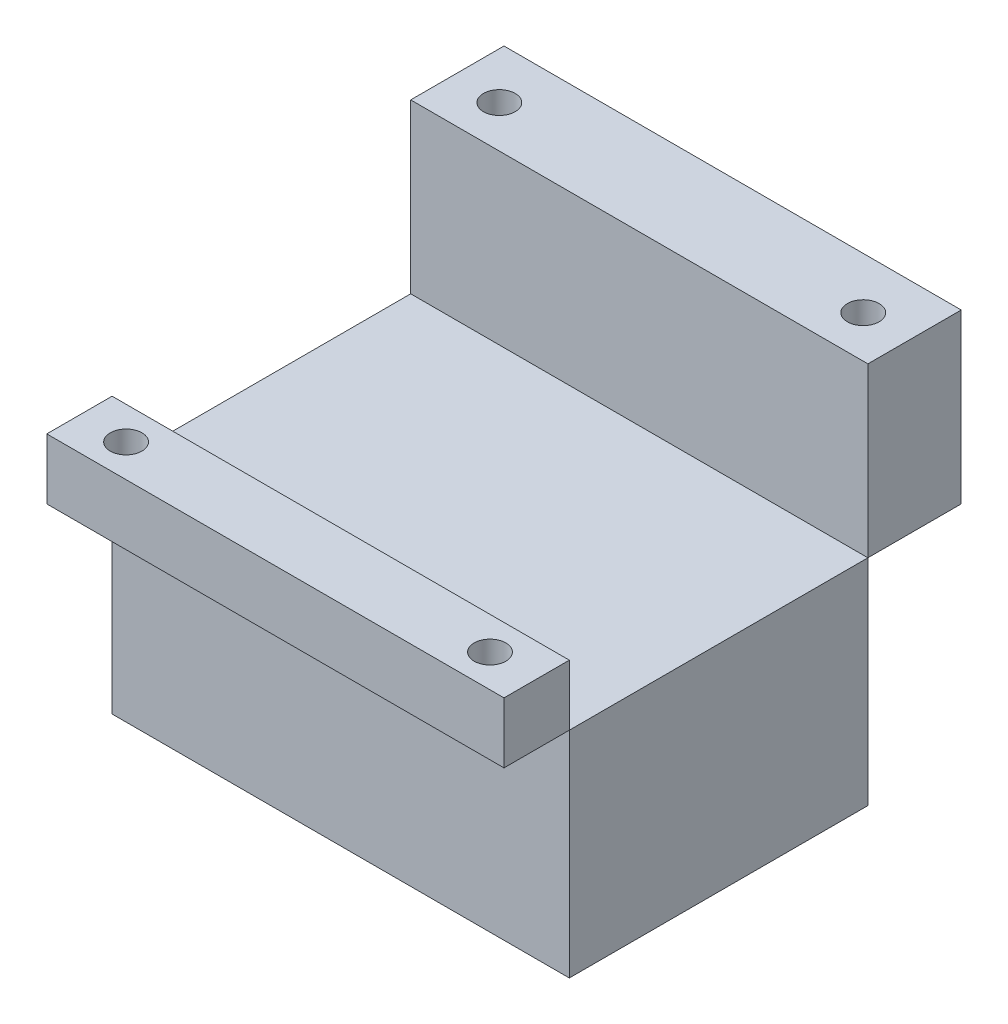
ISO-10303-21;
HEADER;
FILE_DESCRIPTION(('STEP AP214'),'2;1');
FILE_NAME('part.step','',(''),(''),'','','');
FILE_SCHEMA(('AUTOMOTIVE_DESIGN { 1 0 10303 214 1 1 1 1 }'));
ENDSEC;
DATA;
#1=APPLICATION_CONTEXT('core data for automotive mechanical design processes');
#2=APPLICATION_PROTOCOL_DEFINITION('international standard','automotive_design',2000,#1);
#3=PRODUCT_CONTEXT('',#1,'mechanical');
#4=PRODUCT('Part','Part','',(#3));
#5=PRODUCT_RELATED_PRODUCT_CATEGORY('part','',(#4));
#6=PRODUCT_DEFINITION_FORMATION('','',#4);
#7=PRODUCT_DEFINITION_CONTEXT('part definition',#1,'design');
#8=PRODUCT_DEFINITION('design','',#6,#7);
#9=PRODUCT_DEFINITION_SHAPE('','',#8);
#10=(LENGTH_UNIT() NAMED_UNIT(*) SI_UNIT(.MILLI.,.METRE.));
#11=(NAMED_UNIT(*) PLANE_ANGLE_UNIT() SI_UNIT($,.RADIAN.));
#12=(NAMED_UNIT(*) SI_UNIT($,.STERADIAN.) SOLID_ANGLE_UNIT());
#13=UNCERTAINTY_MEASURE_WITH_UNIT(LENGTH_MEASURE(1.E-05),#10,'distance_accuracy_value','');
#14=(GEOMETRIC_REPRESENTATION_CONTEXT(3) GLOBAL_UNCERTAINTY_ASSIGNED_CONTEXT((#13)) GLOBAL_UNIT_ASSIGNED_CONTEXT((#10,
#11,#12)) REPRESENTATION_CONTEXT('',''));
#15=CARTESIAN_POINT('',(0.,0.,0.));
#16=DIRECTION('',(0.,0.,1.));
#17=DIRECTION('',(1.,0.,0.));
#18=AXIS2_PLACEMENT_3D('',#15,#16,#17);
#19=CARTESIAN_POINT('',(-24.5,41.,-16.));
#20=DIRECTION('',(1.,0.,0.));
#21=DIRECTION('',(0.,0.,-1.));
#22=AXIS2_PLACEMENT_3D('',#19,#20,#21);
#23=PLANE('',#22);
#24=DIRECTION('',(0.,0.,1.));
#25=VECTOR('',#24,1.);
#26=CARTESIAN_POINT('',(-24.5,23.,-16.));
#27=LINE('',#26,#25);
#28=CARTESIAN_POINT('',(-24.5,23.,-26.));
#29=VERTEX_POINT('',#28);
#30=CARTESIAN_POINT('',(-24.5,23.,-16.));
#31=VERTEX_POINT('',#30);
#32=EDGE_CURVE('E107',#29,#31,#27,.T.);
#33=ORIENTED_EDGE('',*,*,#32,.T.);
#34=DIRECTION('',(0.,-1.,0.));
#35=VECTOR('',#34,1.);
#36=CARTESIAN_POINT('',(-24.5,41.,-16.));
#37=LINE('',#36,#35);
#38=CARTESIAN_POINT('',(-24.5,41.,-16.));
#39=VERTEX_POINT('',#38);
#40=EDGE_CURVE('E12',#39,#31,#37,.T.);
#41=ORIENTED_EDGE('',*,*,#40,.F.);
#42=DIRECTION('',(0.,0.,1.));
#43=VECTOR('',#42,1.);
#44=CARTESIAN_POINT('',(-24.5,41.,-16.));
#45=LINE('',#44,#43);
#46=CARTESIAN_POINT('',(-24.5,41.,-26.));
#47=VERTEX_POINT('',#46);
#48=EDGE_CURVE('E95',#47,#39,#45,.T.);
#49=ORIENTED_EDGE('',*,*,#48,.F.);
#50=DIRECTION('',(0.,-1.,0.));
#51=VECTOR('',#50,1.);
#52=CARTESIAN_POINT('',(-24.5,41.,-26.));
#53=LINE('',#52,#51);
#54=EDGE_CURVE('E103',#47,#29,#53,.T.);
#55=ORIENTED_EDGE('',*,*,#54,.T.);
#56=EDGE_LOOP('',(#33,#41,#49,#55));
#57=FACE_BOUND('',#56,.T.);
#58=ADVANCED_FACE('F44',(#57),#23,.F.);
#59=CARTESIAN_POINT('',(-24.5,41.,-16.));
#60=DIRECTION('',(0.,0.,-1.));
#61=DIRECTION('',(-1.,0.,0.));
#62=AXIS2_PLACEMENT_3D('',#59,#60,#61);
#63=PLANE('',#62);
#64=DIRECTION('',(1.,0.,0.));
#65=VECTOR('',#64,1.);
#66=CARTESIAN_POINT('',(-24.5,23.,-16.));
#67=LINE('',#66,#65);
#68=CARTESIAN_POINT('',(24.5,23.,-16.));
#69=VERTEX_POINT('',#68);
#70=EDGE_CURVE('E99',#31,#69,#67,.T.);
#71=ORIENTED_EDGE('',*,*,#70,.T.);
#72=DIRECTION('',(0.,-1.,0.));
#73=VECTOR('',#72,1.);
#74=CARTESIAN_POINT('',(24.5,41.,-16.));
#75=LINE('',#74,#73);
#76=CARTESIAN_POINT('',(24.5,41.,-16.));
#77=VERTEX_POINT('',#76);
#78=EDGE_CURVE('E52',#77,#69,#75,.T.);
#79=ORIENTED_EDGE('',*,*,#78,.F.);
#80=DIRECTION('',(1.,0.,0.));
#81=VECTOR('',#80,1.);
#82=CARTESIAN_POINT('',(-24.5,41.,-16.));
#83=LINE('',#82,#81);
#84=EDGE_CURVE('E90',#39,#77,#83,.T.);
#85=ORIENTED_EDGE('',*,*,#84,.F.);
#86=ORIENTED_EDGE('',*,*,#40,.T.);
#87=EDGE_LOOP('',(#71,#79,#85,#86));
#88=FACE_BOUND('',#87,.T.);
#89=ADVANCED_FACE('F98',(#88),#63,.F.);
#90=CARTESIAN_POINT('',(24.5,41.,-16.));
#91=DIRECTION('',(-1.,0.,0.));
#92=DIRECTION('',(0.,0.,1.));
#93=AXIS2_PLACEMENT_3D('',#90,#91,#92);
#94=PLANE('',#93);
#95=DIRECTION('',(0.,0.,-1.));
#96=VECTOR('',#95,1.);
#97=CARTESIAN_POINT('',(24.5,23.,-16.));
#98=LINE('',#97,#96);
#99=CARTESIAN_POINT('',(24.5,23.,-26.));
#100=VERTEX_POINT('',#99);
#101=EDGE_CURVE('E77',#69,#100,#98,.T.);
#102=ORIENTED_EDGE('',*,*,#101,.T.);
#103=DIRECTION('',(0.,-1.,0.));
#104=VECTOR('',#103,1.);
#105=CARTESIAN_POINT('',(24.5,41.,-26.));
#106=LINE('',#105,#104);
#107=CARTESIAN_POINT('',(24.5,41.,-26.));
#108=VERTEX_POINT('',#107);
#109=EDGE_CURVE('E100',#108,#100,#106,.T.);
#110=ORIENTED_EDGE('',*,*,#109,.F.);
#111=DIRECTION('',(0.,0.,-1.));
#112=VECTOR('',#111,1.);
#113=CARTESIAN_POINT('',(24.5,41.,-16.));
#114=LINE('',#113,#112);
#115=EDGE_CURVE('E93',#77,#108,#114,.T.);
#116=ORIENTED_EDGE('',*,*,#115,.F.);
#117=ORIENTED_EDGE('',*,*,#78,.T.);
#118=EDGE_LOOP('',(#102,#110,#116,#117));
#119=FACE_BOUND('',#118,.T.);
#120=ADVANCED_FACE('F101',(#119),#94,.F.);
#121=CARTESIAN_POINT('',(-24.5,41.,-26.));
#122=DIRECTION('',(0.,0.,1.));
#123=DIRECTION('',(1.,0.,0.));
#124=AXIS2_PLACEMENT_3D('',#121,#122,#123);
#125=PLANE('',#124);
#126=DIRECTION('',(-1.,0.,0.));
#127=VECTOR('',#126,1.);
#128=CARTESIAN_POINT('',(-24.5,23.,-26.));
#129=LINE('',#128,#127);
#130=EDGE_CURVE('E83',#100,#29,#129,.T.);
#131=ORIENTED_EDGE('',*,*,#130,.T.);
#132=ORIENTED_EDGE('',*,*,#54,.F.);
#133=DIRECTION('',(-1.,0.,0.));
#134=VECTOR('',#133,1.);
#135=CARTESIAN_POINT('',(-24.5,41.,-26.));
#136=LINE('',#135,#134);
#137=EDGE_CURVE('E60',#108,#47,#136,.T.);
#138=ORIENTED_EDGE('',*,*,#137,.F.);
#139=ORIENTED_EDGE('',*,*,#109,.T.);
#140=EDGE_LOOP('',(#131,#132,#138,#139));
#141=FACE_BOUND('',#140,.T.);
#142=ADVANCED_FACE('F115',(#141),#125,.F.);
#143=CARTESIAN_POINT('',(0.,41.,0.));
#144=DIRECTION('',(0.,-1.,0.));
#145=DIRECTION('',(0.,0.,-1.));
#146=AXIS2_PLACEMENT_3D('',#143,#144,#145);
#147=PLANE('',#146);
#148=CARTESIAN_POINT('',(-19.5,41.,-20.5));
#149=DIRECTION('',(0.,-1.,0.));
#150=DIRECTION('',(0.,0.,-1.));
#151=AXIS2_PLACEMENT_3D('',#148,#149,#150);
#152=CIRCLE('',#151,1.7);
#153=CARTESIAN_POINT('',(-19.5,41.,-22.2));
#154=VERTEX_POINT('',#153);
#155=EDGE_CURVE('E110',#154,#154,#152,.T.);
#156=ORIENTED_EDGE('',*,*,#155,.T.);
#157=EDGE_LOOP('',(#156));
#158=FACE_BOUND('',#157,.T.);
#159=CARTESIAN_POINT('',(19.5,41.,-20.5));
#160=DIRECTION('',(0.,-1.,0.));
#161=DIRECTION('',(0.,0.,-1.));
#162=AXIS2_PLACEMENT_3D('',#159,#160,#161);
#163=CIRCLE('',#162,1.7);
#164=CARTESIAN_POINT('',(19.5,41.,-22.2));
#165=VERTEX_POINT('',#164);
#166=EDGE_CURVE('E124',#165,#165,#163,.T.);
#167=ORIENTED_EDGE('',*,*,#166,.T.);
#168=EDGE_LOOP('',(#167));
#169=FACE_BOUND('',#168,.T.);
#170=ORIENTED_EDGE('',*,*,#48,.T.);
#171=ORIENTED_EDGE('',*,*,#84,.T.);
#172=ORIENTED_EDGE('',*,*,#115,.T.);
#173=ORIENTED_EDGE('',*,*,#137,.T.);
#174=EDGE_LOOP('',(#170,#171,#172,#173));
#175=FACE_BOUND('',#174,.T.);
#176=ADVANCED_FACE('F91',(#158,#169,#175),#147,.F.);
#177=CARTESIAN_POINT('',(0.,23.,0.));
#178=DIRECTION('',(0.,-1.,0.));
#179=DIRECTION('',(0.,0.,-1.));
#180=AXIS2_PLACEMENT_3D('',#177,#178,#179);
#181=PLANE('',#180);
#182=CARTESIAN_POINT('',(-19.5,23.,-20.5));
#183=DIRECTION('',(0.,-1.,0.));
#184=DIRECTION('',(0.,0.,-1.));
#185=AXIS2_PLACEMENT_3D('',#182,#183,#184);
#186=CIRCLE('',#185,1.7);
#187=CARTESIAN_POINT('',(-19.5,23.,-22.2));
#188=VERTEX_POINT('',#187);
#189=EDGE_CURVE('E127',#188,#188,#186,.T.);
#190=ORIENTED_EDGE('',*,*,#189,.F.);
#191=EDGE_LOOP('',(#190));
#192=FACE_BOUND('',#191,.T.);
#193=CARTESIAN_POINT('',(19.5,23.,-20.5));
#194=DIRECTION('',(0.,-1.,0.));
#195=DIRECTION('',(0.,0.,-1.));
#196=AXIS2_PLACEMENT_3D('',#193,#194,#195);
#197=CIRCLE('',#196,1.7);
#198=CARTESIAN_POINT('',(19.5,23.,-22.2));
#199=VERTEX_POINT('',#198);
#200=EDGE_CURVE('E121',#199,#199,#197,.T.);
#201=ORIENTED_EDGE('',*,*,#200,.F.);
#202=EDGE_LOOP('',(#201));
#203=FACE_BOUND('',#202,.T.);
#204=ORIENTED_EDGE('',*,*,#32,.F.);
#205=ORIENTED_EDGE('',*,*,#130,.F.);
#206=ORIENTED_EDGE('',*,*,#101,.F.);
#207=ORIENTED_EDGE('',*,*,#70,.F.);
#208=EDGE_LOOP('',(#204,#205,#206,#207));
#209=FACE_BOUND('',#208,.T.);
#210=ADVANCED_FACE('F118',(#192,#203,#209),#181,.T.);
#211=CARTESIAN_POINT('',(19.5,41.,-20.5));
#212=DIRECTION('',(0.,-1.,0.));
#213=DIRECTION('',(0.,0.,-1.));
#214=AXIS2_PLACEMENT_3D('',#211,#212,#213);
#215=CYLINDRICAL_SURFACE('',#214,1.7);
#216=ORIENTED_EDGE('',*,*,#166,.F.);
#217=EDGE_LOOP('',(#216));
#218=FACE_BOUND('',#217,.T.);
#219=ORIENTED_EDGE('',*,*,#200,.T.);
#220=EDGE_LOOP('',(#219));
#221=FACE_BOUND('',#220,.T.);
#222=ADVANCED_FACE('F138',(#218,#221),#215,.F.);
#223=CARTESIAN_POINT('',(-19.5,41.,-20.5));
#224=DIRECTION('',(0.,-1.,0.));
#225=DIRECTION('',(0.,0.,-1.));
#226=AXIS2_PLACEMENT_3D('',#223,#224,#225);
#227=CYLINDRICAL_SURFACE('',#226,1.7);
#228=ORIENTED_EDGE('',*,*,#155,.F.);
#229=EDGE_LOOP('',(#228));
#230=FACE_BOUND('',#229,.T.);
#231=ORIENTED_EDGE('',*,*,#189,.T.);
#232=EDGE_LOOP('',(#231));
#233=FACE_BOUND('',#232,.T.);
#234=ADVANCED_FACE('F135',(#230,#233),#227,.F.);
#235=CLOSED_SHELL('',(#58,#89,#120,#142,#176,#210,#222,#234));
#236=MANIFOLD_SOLID_BREP('B2',#235);
#237=CARTESIAN_POINT('',(24.5,29.5,16.));
#238=DIRECTION('',(-1.,0.,0.));
#239=DIRECTION('',(0.,0.,1.));
#240=AXIS2_PLACEMENT_3D('',#237,#238,#239);
#241=PLANE('',#240);
#242=DIRECTION('',(0.,0.,-1.));
#243=VECTOR('',#242,1.);
#244=CARTESIAN_POINT('',(24.5,23.,16.));
#245=LINE('',#244,#243);
#246=CARTESIAN_POINT('',(24.5,23.,23.));
#247=VERTEX_POINT('',#246);
#248=CARTESIAN_POINT('',(24.5,23.,16.));
#249=VERTEX_POINT('',#248);
#250=EDGE_CURVE('E282',#247,#249,#245,.T.);
#251=ORIENTED_EDGE('',*,*,#250,.T.);
#252=DIRECTION('',(0.,-1.,0.));
#253=VECTOR('',#252,1.);
#254=CARTESIAN_POINT('',(24.5,29.5,16.));
#255=LINE('',#254,#253);
#256=CARTESIAN_POINT('',(24.5,29.5,16.));
#257=VERTEX_POINT('',#256);
#258=EDGE_CURVE('E42',#257,#249,#255,.T.);
#259=ORIENTED_EDGE('',*,*,#258,.F.);
#260=DIRECTION('',(0.,0.,-1.));
#261=VECTOR('',#260,1.);
#262=CARTESIAN_POINT('',(24.5,29.5,16.));
#263=LINE('',#262,#261);
#264=CARTESIAN_POINT('',(24.5,29.5,23.));
#265=VERTEX_POINT('',#264);
#266=EDGE_CURVE('E270',#265,#257,#263,.T.);
#267=ORIENTED_EDGE('',*,*,#266,.F.);
#268=DIRECTION('',(0.,-1.,0.));
#269=VECTOR('',#268,1.);
#270=CARTESIAN_POINT('',(24.5,29.5,23.));
#271=LINE('',#270,#269);
#272=EDGE_CURVE('E278',#265,#247,#271,.T.);
#273=ORIENTED_EDGE('',*,*,#272,.T.);
#274=EDGE_LOOP('',(#251,#259,#267,#273));
#275=FACE_BOUND('',#274,.T.);
#276=ADVANCED_FACE('F219',(#275),#241,.F.);
#277=CARTESIAN_POINT('',(24.5,29.5,16.));
#278=DIRECTION('',(0.,0.,1.));
#279=DIRECTION('',(1.,0.,0.));
#280=AXIS2_PLACEMENT_3D('',#277,#278,#279);
#281=PLANE('',#280);
#282=DIRECTION('',(-1.,0.,0.));
#283=VECTOR('',#282,1.);
#284=CARTESIAN_POINT('',(24.5,23.,16.));
#285=LINE('',#284,#283);
#286=CARTESIAN_POINT('',(-24.5,23.,16.));
#287=VERTEX_POINT('',#286);
#288=EDGE_CURVE('E274',#249,#287,#285,.T.);
#289=ORIENTED_EDGE('',*,*,#288,.T.);
#290=DIRECTION('',(0.,-1.,0.));
#291=VECTOR('',#290,1.);
#292=CARTESIAN_POINT('',(-24.5,29.5,16.));
#293=LINE('',#292,#291);
#294=CARTESIAN_POINT('',(-24.5,29.5,16.));
#295=VERTEX_POINT('',#294);
#296=EDGE_CURVE('E227',#295,#287,#293,.T.);
#297=ORIENTED_EDGE('',*,*,#296,.F.);
#298=DIRECTION('',(-1.,0.,0.));
#299=VECTOR('',#298,1.);
#300=CARTESIAN_POINT('',(24.5,29.5,16.));
#301=LINE('',#300,#299);
#302=EDGE_CURVE('E265',#257,#295,#301,.T.);
#303=ORIENTED_EDGE('',*,*,#302,.F.);
#304=ORIENTED_EDGE('',*,*,#258,.T.);
#305=EDGE_LOOP('',(#289,#297,#303,#304));
#306=FACE_BOUND('',#305,.T.);
#307=ADVANCED_FACE('F273',(#306),#281,.F.);
#308=CARTESIAN_POINT('',(-24.5,29.5,16.));
#309=DIRECTION('',(1.,0.,0.));
#310=DIRECTION('',(0.,0.,-1.));
#311=AXIS2_PLACEMENT_3D('',#308,#309,#310);
#312=PLANE('',#311);
#313=DIRECTION('',(0.,0.,1.));
#314=VECTOR('',#313,1.);
#315=CARTESIAN_POINT('',(-24.5,23.,16.));
#316=LINE('',#315,#314);
#317=CARTESIAN_POINT('',(-24.5,23.,23.));
#318=VERTEX_POINT('',#317);
#319=EDGE_CURVE('E252',#287,#318,#316,.T.);
#320=ORIENTED_EDGE('',*,*,#319,.T.);
#321=DIRECTION('',(0.,-1.,0.));
#322=VECTOR('',#321,1.);
#323=CARTESIAN_POINT('',(-24.5,29.5,23.));
#324=LINE('',#323,#322);
#325=CARTESIAN_POINT('',(-24.5,29.5,23.));
#326=VERTEX_POINT('',#325);
#327=EDGE_CURVE('E275',#326,#318,#324,.T.);
#328=ORIENTED_EDGE('',*,*,#327,.F.);
#329=DIRECTION('',(0.,0.,1.));
#330=VECTOR('',#329,1.);
#331=CARTESIAN_POINT('',(-24.5,29.5,16.));
#332=LINE('',#331,#330);
#333=EDGE_CURVE('E268',#295,#326,#332,.T.);
#334=ORIENTED_EDGE('',*,*,#333,.F.);
#335=ORIENTED_EDGE('',*,*,#296,.T.);
#336=EDGE_LOOP('',(#320,#328,#334,#335));
#337=FACE_BOUND('',#336,.T.);
#338=ADVANCED_FACE('F276',(#337),#312,.F.);
#339=CARTESIAN_POINT('',(24.5,29.5,23.));
#340=DIRECTION('',(0.,0.,-1.));
#341=DIRECTION('',(-1.,0.,0.));
#342=AXIS2_PLACEMENT_3D('',#339,#340,#341);
#343=PLANE('',#342);
#344=DIRECTION('',(1.,0.,0.));
#345=VECTOR('',#344,1.);
#346=CARTESIAN_POINT('',(24.5,23.,23.));
#347=LINE('',#346,#345);
#348=EDGE_CURVE('E258',#318,#247,#347,.T.);
#349=ORIENTED_EDGE('',*,*,#348,.T.);
#350=ORIENTED_EDGE('',*,*,#272,.F.);
#351=DIRECTION('',(1.,0.,0.));
#352=VECTOR('',#351,1.);
#353=CARTESIAN_POINT('',(24.5,29.5,23.));
#354=LINE('',#353,#352);
#355=EDGE_CURVE('E235',#326,#265,#354,.T.);
#356=ORIENTED_EDGE('',*,*,#355,.F.);
#357=ORIENTED_EDGE('',*,*,#327,.T.);
#358=EDGE_LOOP('',(#349,#350,#356,#357));
#359=FACE_BOUND('',#358,.T.);
#360=ADVANCED_FACE('F290',(#359),#343,.F.);
#361=CARTESIAN_POINT('',(0.,29.5,0.));
#362=DIRECTION('',(0.,-1.,0.));
#363=DIRECTION('',(0.,0.,-1.));
#364=AXIS2_PLACEMENT_3D('',#361,#362,#363);
#365=PLANE('',#364);
#366=CARTESIAN_POINT('',(19.5,29.5,19.5));
#367=DIRECTION('',(0.,-1.,0.));
#368=DIRECTION('',(0.,0.,-1.));
#369=AXIS2_PLACEMENT_3D('',#366,#367,#368);
#370=CIRCLE('',#369,1.7);
#371=CARTESIAN_POINT('',(19.5,29.5,17.8));
#372=VERTEX_POINT('',#371);
#373=EDGE_CURVE('E285',#372,#372,#370,.T.);
#374=ORIENTED_EDGE('',*,*,#373,.T.);
#375=EDGE_LOOP('',(#374));
#376=FACE_BOUND('',#375,.T.);
#377=CARTESIAN_POINT('',(-19.5,29.5,19.5));
#378=DIRECTION('',(0.,-1.,0.));
#379=DIRECTION('',(0.,0.,-1.));
#380=AXIS2_PLACEMENT_3D('',#377,#378,#379);
#381=CIRCLE('',#380,1.7);
#382=CARTESIAN_POINT('',(-19.5,29.5,17.8));
#383=VERTEX_POINT('',#382);
#384=EDGE_CURVE('E298',#383,#383,#381,.T.);
#385=ORIENTED_EDGE('',*,*,#384,.T.);
#386=EDGE_LOOP('',(#385));
#387=FACE_BOUND('',#386,.T.);
#388=ORIENTED_EDGE('',*,*,#266,.T.);
#389=ORIENTED_EDGE('',*,*,#302,.T.);
#390=ORIENTED_EDGE('',*,*,#333,.T.);
#391=ORIENTED_EDGE('',*,*,#355,.T.);
#392=EDGE_LOOP('',(#388,#389,#390,#391));
#393=FACE_BOUND('',#392,.T.);
#394=ADVANCED_FACE('F266',(#376,#387,#393),#365,.F.);
#395=CARTESIAN_POINT('',(0.,23.,0.));
#396=DIRECTION('',(0.,-1.,0.));
#397=DIRECTION('',(0.,0.,-1.));
#398=AXIS2_PLACEMENT_3D('',#395,#396,#397);
#399=PLANE('',#398);
#400=CARTESIAN_POINT('',(19.5,23.,19.5));
#401=DIRECTION('',(0.,-1.,0.));
#402=DIRECTION('',(0.,0.,-1.));
#403=AXIS2_PLACEMENT_3D('',#400,#401,#402);
#404=CIRCLE('',#403,1.7);
#405=CARTESIAN_POINT('',(19.5,23.,17.8));
#406=VERTEX_POINT('',#405);
#407=EDGE_CURVE('E301',#406,#406,#404,.T.);
#408=ORIENTED_EDGE('',*,*,#407,.F.);
#409=EDGE_LOOP('',(#408));
#410=FACE_BOUND('',#409,.T.);
#411=CARTESIAN_POINT('',(-19.5,23.,19.5));
#412=DIRECTION('',(0.,-1.,0.));
#413=DIRECTION('',(0.,0.,-1.));
#414=AXIS2_PLACEMENT_3D('',#411,#412,#413);
#415=CIRCLE('',#414,1.7);
#416=CARTESIAN_POINT('',(-19.5,23.,17.8));
#417=VERTEX_POINT('',#416);
#418=EDGE_CURVE('E302',#417,#417,#415,.T.);
#419=ORIENTED_EDGE('',*,*,#418,.F.);
#420=EDGE_LOOP('',(#419));
#421=FACE_BOUND('',#420,.T.);
#422=ORIENTED_EDGE('',*,*,#250,.F.);
#423=ORIENTED_EDGE('',*,*,#348,.F.);
#424=ORIENTED_EDGE('',*,*,#319,.F.);
#425=ORIENTED_EDGE('',*,*,#288,.F.);
#426=EDGE_LOOP('',(#422,#423,#424,#425));
#427=FACE_BOUND('',#426,.T.);
#428=ADVANCED_FACE('F293',(#410,#421,#427),#399,.T.);
#429=CARTESIAN_POINT('',(-19.5,41.,19.5));
#430=DIRECTION('',(0.,-1.,0.));
#431=DIRECTION('',(0.,0.,-1.));
#432=AXIS2_PLACEMENT_3D('',#429,#430,#431);
#433=CYLINDRICAL_SURFACE('',#432,1.7);
#434=ORIENTED_EDGE('',*,*,#418,.T.);
#435=EDGE_LOOP('',(#434));
#436=FACE_BOUND('',#435,.T.);
#437=ORIENTED_EDGE('',*,*,#384,.F.);
#438=EDGE_LOOP('',(#437));
#439=FACE_BOUND('',#438,.T.);
#440=ADVANCED_FACE('F313',(#436,#439),#433,.F.);
#441=CARTESIAN_POINT('',(19.5,41.,19.5));
#442=DIRECTION('',(0.,-1.,0.));
#443=DIRECTION('',(0.,0.,-1.));
#444=AXIS2_PLACEMENT_3D('',#441,#442,#443);
#445=CYLINDRICAL_SURFACE('',#444,1.7);
#446=ORIENTED_EDGE('',*,*,#407,.T.);
#447=EDGE_LOOP('',(#446));
#448=FACE_BOUND('',#447,.T.);
#449=ORIENTED_EDGE('',*,*,#373,.F.);
#450=EDGE_LOOP('',(#449));
#451=FACE_BOUND('',#450,.T.);
#452=ADVANCED_FACE('F308',(#448,#451),#445,.F.);
#453=CLOSED_SHELL('',(#276,#307,#338,#360,#394,#428,#440,#452));
#454=MANIFOLD_SOLID_BREP('B6',#453);
#455=CARTESIAN_POINT('',(24.5,23.,-16.));
#456=DIRECTION('',(-1.,0.,0.));
#457=DIRECTION('',(0.,0.,1.));
#458=AXIS2_PLACEMENT_3D('',#455,#456,#457);
#459=PLANE('',#458);
#460=DIRECTION('',(0.,0.,-1.));
#461=VECTOR('',#460,1.);
#462=CARTESIAN_POINT('',(24.5,0.,-16.));
#463=LINE('',#462,#461);
#464=CARTESIAN_POINT('',(24.5,0.,16.));
#465=VERTEX_POINT('',#464);
#466=CARTESIAN_POINT('',(24.5,0.,-16.));
#467=VERTEX_POINT('',#466);
#468=EDGE_CURVE('E448',#465,#467,#463,.T.);
#469=ORIENTED_EDGE('',*,*,#468,.T.);
#470=DIRECTION('',(0.,-1.,0.));
#471=VECTOR('',#470,1.);
#472=CARTESIAN_POINT('',(24.5,23.,-16.));
#473=LINE('',#472,#471);
#474=CARTESIAN_POINT('',(24.5,23.,-16.));
#475=VERTEX_POINT('',#474);
#476=EDGE_CURVE('E217',#475,#467,#473,.T.);
#477=ORIENTED_EDGE('',*,*,#476,.F.);
#478=DIRECTION('',(0.,0.,-1.));
#479=VECTOR('',#478,1.);
#480=CARTESIAN_POINT('',(24.5,23.,-16.));
#481=LINE('',#480,#479);
#482=CARTESIAN_POINT('',(24.5,23.,16.));
#483=VERTEX_POINT('',#482);
#484=EDGE_CURVE('E436',#483,#475,#481,.T.);
#485=ORIENTED_EDGE('',*,*,#484,.F.);
#486=DIRECTION('',(0.,-1.,0.));
#487=VECTOR('',#486,1.);
#488=CARTESIAN_POINT('',(24.5,23.,16.));
#489=LINE('',#488,#487);
#490=EDGE_CURVE('E444',#483,#465,#489,.T.);
#491=ORIENTED_EDGE('',*,*,#490,.T.);
#492=EDGE_LOOP('',(#469,#477,#485,#491));
#493=FACE_BOUND('',#492,.T.);
#494=ADVANCED_FACE('F385',(#493),#459,.F.);
#495=CARTESIAN_POINT('',(-24.5,23.,-16.));
#496=DIRECTION('',(0.,0.,1.));
#497=DIRECTION('',(1.,0.,0.));
#498=AXIS2_PLACEMENT_3D('',#495,#496,#497);
#499=PLANE('',#498);
#500=DIRECTION('',(-1.,0.,0.));
#501=VECTOR('',#500,1.);
#502=CARTESIAN_POINT('',(-24.5,0.,-16.));
#503=LINE('',#502,#501);
#504=CARTESIAN_POINT('',(-24.5,0.,-16.));
#505=VERTEX_POINT('',#504);
#506=EDGE_CURVE('E440',#467,#505,#503,.T.);
#507=ORIENTED_EDGE('',*,*,#506,.T.);
#508=DIRECTION('',(0.,-1.,0.));
#509=VECTOR('',#508,1.);
#510=CARTESIAN_POINT('',(-24.5,23.,-16.));
#511=LINE('',#510,#509);
#512=CARTESIAN_POINT('',(-24.5,23.,-16.));
#513=VERTEX_POINT('',#512);
#514=EDGE_CURVE('E393',#513,#505,#511,.T.);
#515=ORIENTED_EDGE('',*,*,#514,.F.);
#516=DIRECTION('',(-1.,0.,0.));
#517=VECTOR('',#516,1.);
#518=CARTESIAN_POINT('',(-24.5,23.,-16.));
#519=LINE('',#518,#517);
#520=EDGE_CURVE('E431',#475,#513,#519,.T.);
#521=ORIENTED_EDGE('',*,*,#520,.F.);
#522=ORIENTED_EDGE('',*,*,#476,.T.);
#523=EDGE_LOOP('',(#507,#515,#521,#522));
#524=FACE_BOUND('',#523,.T.);
#525=ADVANCED_FACE('F439',(#524),#499,.F.);
#526=CARTESIAN_POINT('',(-24.5,23.,-16.));
#527=DIRECTION('',(1.,0.,0.));
#528=DIRECTION('',(0.,0.,-1.));
#529=AXIS2_PLACEMENT_3D('',#526,#527,#528);
#530=PLANE('',#529);
#531=DIRECTION('',(0.,0.,1.));
#532=VECTOR('',#531,1.);
#533=CARTESIAN_POINT('',(-24.5,0.,-16.));
#534=LINE('',#533,#532);
#535=CARTESIAN_POINT('',(-24.5,0.,16.));
#536=VERTEX_POINT('',#535);
#537=EDGE_CURVE('E418',#505,#536,#534,.T.);
#538=ORIENTED_EDGE('',*,*,#537,.T.);
#539=DIRECTION('',(0.,-1.,0.));
#540=VECTOR('',#539,1.);
#541=CARTESIAN_POINT('',(-24.5,23.,16.));
#542=LINE('',#541,#540);
#543=CARTESIAN_POINT('',(-24.5,23.,16.));
#544=VERTEX_POINT('',#543);
#545=EDGE_CURVE('E441',#544,#536,#542,.T.);
#546=ORIENTED_EDGE('',*,*,#545,.F.);
#547=DIRECTION('',(0.,0.,1.));
#548=VECTOR('',#547,1.);
#549=CARTESIAN_POINT('',(-24.5,23.,-16.));
#550=LINE('',#549,#548);
#551=EDGE_CURVE('E434',#513,#544,#550,.T.);
#552=ORIENTED_EDGE('',*,*,#551,.F.);
#553=ORIENTED_EDGE('',*,*,#514,.T.);
#554=EDGE_LOOP('',(#538,#546,#552,#553));
#555=FACE_BOUND('',#554,.T.);
#556=ADVANCED_FACE('F442',(#555),#530,.F.);
#557=CARTESIAN_POINT('',(-24.5,23.,16.));
#558=DIRECTION('',(0.,0.,-1.));
#559=DIRECTION('',(-1.,0.,0.));
#560=AXIS2_PLACEMENT_3D('',#557,#558,#559);
#561=PLANE('',#560);
#562=DIRECTION('',(1.,0.,0.));
#563=VECTOR('',#562,1.);
#564=CARTESIAN_POINT('',(-24.5,0.,16.));
#565=LINE('',#564,#563);
#566=EDGE_CURVE('E424',#536,#465,#565,.T.);
#567=ORIENTED_EDGE('',*,*,#566,.T.);
#568=ORIENTED_EDGE('',*,*,#490,.F.);
#569=DIRECTION('',(1.,0.,0.));
#570=VECTOR('',#569,1.);
#571=CARTESIAN_POINT('',(-24.5,23.,16.));
#572=LINE('',#571,#570);
#573=EDGE_CURVE('E401',#544,#483,#572,.T.);
#574=ORIENTED_EDGE('',*,*,#573,.F.);
#575=ORIENTED_EDGE('',*,*,#545,.T.);
#576=EDGE_LOOP('',(#567,#568,#574,#575));
#577=FACE_BOUND('',#576,.T.);
#578=ADVANCED_FACE('F455',(#577),#561,.F.);
#579=CARTESIAN_POINT('',(0.,23.,0.));
#580=DIRECTION('',(0.,1.,0.));
#581=DIRECTION('',(0.,0.,1.));
#582=AXIS2_PLACEMENT_3D('',#579,#580,#581);
#583=PLANE('',#582);
#584=ORIENTED_EDGE('',*,*,#484,.T.);
#585=ORIENTED_EDGE('',*,*,#520,.T.);
#586=ORIENTED_EDGE('',*,*,#551,.T.);
#587=ORIENTED_EDGE('',*,*,#573,.T.);
#588=EDGE_LOOP('',(#584,#585,#586,#587));
#589=FACE_BOUND('',#588,.T.);
#590=ADVANCED_FACE('F432',(#589),#583,.T.);
#591=CARTESIAN_POINT('',(0.,0.,0.));
#592=DIRECTION('',(0.,1.,0.));
#593=DIRECTION('',(0.,0.,1.));
#594=AXIS2_PLACEMENT_3D('',#591,#592,#593);
#595=PLANE('',#594);
#596=ORIENTED_EDGE('',*,*,#468,.F.);
#597=ORIENTED_EDGE('',*,*,#566,.F.);
#598=ORIENTED_EDGE('',*,*,#537,.F.);
#599=ORIENTED_EDGE('',*,*,#506,.F.);
#600=EDGE_LOOP('',(#596,#597,#598,#599));
#601=FACE_BOUND('',#600,.T.);
#602=ADVANCED_FACE('F458',(#601),#595,.F.);
#603=CLOSED_SHELL('',(#494,#525,#556,#578,#590,#602));
#604=MANIFOLD_SOLID_BREP('B36',#603);
#605=ADVANCED_BREP_SHAPE_REPRESENTATION('',(#18,#236,#454,#604),#14);
#606=SHAPE_DEFINITION_REPRESENTATION(#9,#605);
ENDSEC;
END-ISO-10303-21;
